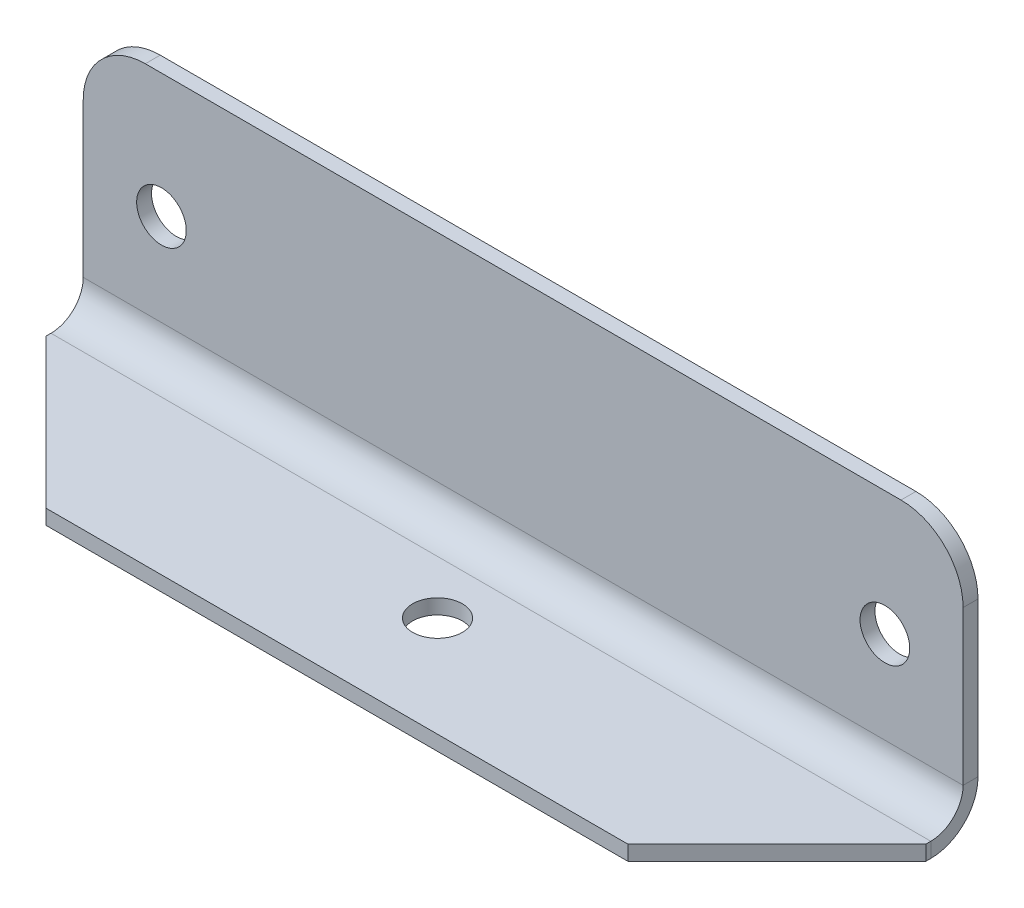
ISO-10303-21;
HEADER;
FILE_DESCRIPTION(('STEP AP214'),'2;1');
FILE_NAME('part.step','',(''),(''),'','','');
FILE_SCHEMA(('AUTOMOTIVE_DESIGN { 1 0 10303 214 1 1 1 1 }'));
ENDSEC;
DATA;
#1=APPLICATION_CONTEXT('core data for automotive mechanical design processes');
#2=APPLICATION_PROTOCOL_DEFINITION('international standard','automotive_design',2000,#1);
#3=PRODUCT_CONTEXT('',#1,'mechanical');
#4=PRODUCT('Part','Part','',(#3));
#5=PRODUCT_RELATED_PRODUCT_CATEGORY('part','',(#4));
#6=PRODUCT_DEFINITION_FORMATION('','',#4);
#7=PRODUCT_DEFINITION_CONTEXT('part definition',#1,'design');
#8=PRODUCT_DEFINITION('design','',#6,#7);
#9=PRODUCT_DEFINITION_SHAPE('','',#8);
#10=(LENGTH_UNIT() NAMED_UNIT(*) SI_UNIT(.MILLI.,.METRE.));
#11=(NAMED_UNIT(*) PLANE_ANGLE_UNIT() SI_UNIT($,.RADIAN.));
#12=(NAMED_UNIT(*) SI_UNIT($,.STERADIAN.) SOLID_ANGLE_UNIT());
#13=UNCERTAINTY_MEASURE_WITH_UNIT(LENGTH_MEASURE(1.E-05),#10,'distance_accuracy_value','');
#14=(GEOMETRIC_REPRESENTATION_CONTEXT(3) GLOBAL_UNCERTAINTY_ASSIGNED_CONTEXT((#13)) GLOBAL_UNIT_ASSIGNED_CONTEXT((#10,
#11,#12)) REPRESENTATION_CONTEXT('',''));
#15=CARTESIAN_POINT('',(0.,0.,0.));
#16=DIRECTION('',(0.,0.,1.));
#17=DIRECTION('',(1.,0.,0.));
#18=AXIS2_PLACEMENT_3D('',#15,#16,#17);
#19=CARTESIAN_POINT('',(45.,1.651,0.));
#20=DIRECTION('',(1.,0.,0.));
#21=DIRECTION('',(0.,0.,-1.));
#22=AXIS2_PLACEMENT_3D('',#19,#20,#21);
#23=PLANE('',#22);
#24=DIRECTION('',(0.,0.,-1.));
#25=VECTOR('',#24,1.);
#26=CARTESIAN_POINT('',(45.,1.651,0.));
#27=LINE('',#26,#25);
#28=CARTESIAN_POINT('',(45.,1.651,0.));
#29=VERTEX_POINT('',#28);
#30=CARTESIAN_POINT('',(45.,1.651,-0.762));
#31=VERTEX_POINT('',#30);
#32=EDGE_CURVE('E126',#29,#31,#27,.T.);
#33=ORIENTED_EDGE('',*,*,#32,.F.);
#34=CARTESIAN_POINT('',(45.,1.651,1.651));
#35=DIRECTION('',(-1.,0.,0.));
#36=DIRECTION('',(0.,0.,1.));
#37=AXIS2_PLACEMENT_3D('',#34,#35,#36);
#38=CIRCLE('',#37,1.651);
#39=CARTESIAN_POINT('',(45.,0.,1.65100000000001));
#40=VERTEX_POINT('',#39);
#41=EDGE_CURVE('E130',#40,#29,#38,.F.);
#42=ORIENTED_EDGE('',*,*,#41,.F.);
#43=DIRECTION('',(0.,1.,0.));
#44=VECTOR('',#43,1.);
#45=CARTESIAN_POINT('',(45.,-0.761999999999999,1.65100000000001));
#46=LINE('',#45,#44);
#47=CARTESIAN_POINT('',(45.,-0.761999999999999,1.65100000000001));
#48=VERTEX_POINT('',#47);
#49=EDGE_CURVE('E135',#48,#40,#46,.T.);
#50=ORIENTED_EDGE('',*,*,#49,.F.);
#51=CARTESIAN_POINT('',(45.,1.651,1.651));
#52=DIRECTION('',(1.,0.,0.));
#53=DIRECTION('',(0.,0.,-1.));
#54=AXIS2_PLACEMENT_3D('',#51,#52,#53);
#55=CIRCLE('',#54,2.413);
#56=EDGE_CURVE('E132',#48,#31,#55,.T.);
#57=ORIENTED_EDGE('',*,*,#56,.T.);
#58=EDGE_LOOP('',(#33,#42,#50,#57));
#59=FACE_BOUND('',#58,.T.);
#60=ADVANCED_FACE('F33',(#59),#23,.T.);
#61=CARTESIAN_POINT('',(45.,-0.761999999999999,1.65100000000001));
#62=DIRECTION('',(1.,0.,0.));
#63=DIRECTION('',(0.,0.,-1.));
#64=AXIS2_PLACEMENT_3D('',#61,#62,#63);
#65=PLANE('',#64);
#66=DIRECTION('',(0.,1.,0.));
#67=VECTOR('',#66,1.);
#68=CARTESIAN_POINT('',(45.,0.,-0.762));
#69=LINE('',#68,#67);
#70=CARTESIAN_POINT('',(45.,9.52499999999999,-0.762));
#71=VERTEX_POINT('',#70);
#72=EDGE_CURVE('E150',#31,#71,#69,.T.);
#73=ORIENTED_EDGE('',*,*,#72,.T.);
#74=DIRECTION('',(0.,0.,-1.));
#75=VECTOR('',#74,1.);
#76=CARTESIAN_POINT('',(45.,9.52500000000001,1.65099999999997));
#77=LINE('',#76,#75);
#78=CARTESIAN_POINT('',(45.,9.525,0.));
#79=VERTEX_POINT('',#78);
#80=EDGE_CURVE('E56',#71,#79,#77,.F.);
#81=ORIENTED_EDGE('',*,*,#80,.T.);
#82=DIRECTION('',(0.,1.,0.));
#83=VECTOR('',#82,1.);
#84=CARTESIAN_POINT('',(45.,0.,0.));
#85=LINE('',#84,#83);
#86=EDGE_CURVE('E140',#29,#79,#85,.T.);
#87=ORIENTED_EDGE('',*,*,#86,.F.);
#88=ORIENTED_EDGE('',*,*,#32,.T.);
#89=EDGE_LOOP('',(#73,#81,#87,#88));
#90=FACE_BOUND('',#89,.T.);
#91=ADVANCED_FACE('F149',(#90),#65,.T.);
#92=CARTESIAN_POINT('',(0.,0.,1.65100000000001));
#93=DIRECTION('',(-1.,0.,0.));
#94=DIRECTION('',(0.,0.,1.));
#95=AXIS2_PLACEMENT_3D('',#92,#93,#94);
#96=PLANE('',#95);
#97=DIRECTION('',(0.,-1.,0.));
#98=VECTOR('',#97,1.);
#99=CARTESIAN_POINT('',(0.,0.,1.65100000000001));
#100=LINE('',#99,#98);
#101=CARTESIAN_POINT('',(0.,0.,1.65100000000001));
#102=VERTEX_POINT('',#101);
#103=CARTESIAN_POINT('',(0.,-0.761999999999999,1.65100000000001));
#104=VERTEX_POINT('',#103);
#105=EDGE_CURVE('E196',#102,#104,#100,.T.);
#106=ORIENTED_EDGE('',*,*,#105,.F.);
#107=CARTESIAN_POINT('',(0.,1.651,1.651));
#108=DIRECTION('',(-1.,0.,0.));
#109=DIRECTION('',(0.,0.,1.));
#110=AXIS2_PLACEMENT_3D('',#107,#108,#109);
#111=CIRCLE('',#110,1.651);
#112=CARTESIAN_POINT('',(0.,1.651,0.));
#113=VERTEX_POINT('',#112);
#114=EDGE_CURVE('E169',#102,#113,#111,.F.);
#115=ORIENTED_EDGE('',*,*,#114,.T.);
#116=DIRECTION('',(0.,0.,1.));
#117=VECTOR('',#116,1.);
#118=CARTESIAN_POINT('',(0.,1.651,-0.762));
#119=LINE('',#118,#117);
#120=CARTESIAN_POINT('',(0.,1.651,-0.762));
#121=VERTEX_POINT('',#120);
#122=EDGE_CURVE('E194',#121,#113,#119,.T.);
#123=ORIENTED_EDGE('',*,*,#122,.F.);
#124=CARTESIAN_POINT('',(0.,1.651,1.651));
#125=DIRECTION('',(1.,0.,0.));
#126=DIRECTION('',(0.,0.,-1.));
#127=AXIS2_PLACEMENT_3D('',#124,#125,#126);
#128=CIRCLE('',#127,2.413);
#129=EDGE_CURVE('E175',#104,#121,#128,.T.);
#130=ORIENTED_EDGE('',*,*,#129,.F.);
#131=EDGE_LOOP('',(#106,#115,#123,#130));
#132=FACE_BOUND('',#131,.T.);
#133=ADVANCED_FACE('F295',(#132),#96,.T.);
#134=CARTESIAN_POINT('',(0.,1.651,-0.762));
#135=DIRECTION('',(-1.,0.,0.));
#136=DIRECTION('',(0.,0.,1.));
#137=AXIS2_PLACEMENT_3D('',#134,#135,#136);
#138=PLANE('',#137);
#139=DIRECTION('',(0.,0.,-1.));
#140=VECTOR('',#139,1.);
#141=CARTESIAN_POINT('',(0.,-0.762,9.525));
#142=LINE('',#141,#140);
#143=CARTESIAN_POINT('',(0.,-0.762,1.905));
#144=VERTEX_POINT('',#143);
#145=EDGE_CURVE('E173',#144,#104,#142,.T.);
#146=ORIENTED_EDGE('',*,*,#145,.F.);
#147=DIRECTION('',(0.,1.,0.));
#148=VECTOR('',#147,1.);
#149=CARTESIAN_POINT('',(0.,1.651,1.905));
#150=LINE('',#149,#148);
#151=CARTESIAN_POINT('',(0.,0.,1.90499999999999));
#152=VERTEX_POINT('',#151);
#153=EDGE_CURVE('E215',#144,#152,#150,.T.);
#154=ORIENTED_EDGE('',*,*,#153,.T.);
#155=DIRECTION('',(0.,0.,-1.));
#156=VECTOR('',#155,1.);
#157=CARTESIAN_POINT('',(0.,0.,9.525));
#158=LINE('',#157,#156);
#159=EDGE_CURVE('E171',#152,#102,#158,.T.);
#160=ORIENTED_EDGE('',*,*,#159,.T.);
#161=ORIENTED_EDGE('',*,*,#105,.T.);
#162=EDGE_LOOP('',(#146,#154,#160,#161));
#163=FACE_BOUND('',#162,.T.);
#164=ADVANCED_FACE('F289',(#163),#138,.T.);
#165=CARTESIAN_POINT('',(45.,0.,-0.762));
#166=DIRECTION('',(0.,0.,1.));
#167=DIRECTION('',(1.,0.,0.));
#168=AXIS2_PLACEMENT_3D('',#165,#166,#167);
#169=PLANE('',#168);
#170=CARTESIAN_POINT('',(4.,6.35,-0.762));
#171=DIRECTION('',(0.,0.,-1.));
#172=DIRECTION('',(-1.,0.,0.));
#173=AXIS2_PLACEMENT_3D('',#170,#171,#172);
#174=CIRCLE('',#173,1.27);
#175=CARTESIAN_POINT('',(2.73,6.35,-0.762));
#176=VERTEX_POINT('',#175);
#177=EDGE_CURVE('E246',#176,#176,#174,.T.);
#178=ORIENTED_EDGE('',*,*,#177,.F.);
#179=EDGE_LOOP('',(#178));
#180=FACE_BOUND('',#179,.T.);
#181=CARTESIAN_POINT('',(41.,6.35,-0.762));
#182=DIRECTION('',(0.,0.,-1.));
#183=DIRECTION('',(-1.,0.,0.));
#184=AXIS2_PLACEMENT_3D('',#181,#182,#183);
#185=CIRCLE('',#184,1.27);
#186=CARTESIAN_POINT('',(39.73,6.35,-0.762));
#187=VERTEX_POINT('',#186);
#188=EDGE_CURVE('E240',#187,#187,#185,.T.);
#189=ORIENTED_EDGE('',*,*,#188,.F.);
#190=EDGE_LOOP('',(#189));
#191=FACE_BOUND('',#190,.T.);
#192=DIRECTION('',(-1.,0.,0.));
#193=VECTOR('',#192,1.);
#194=CARTESIAN_POINT('',(45.,12.7,-0.762));
#195=LINE('',#194,#193);
#196=CARTESIAN_POINT('',(41.825,12.7,-0.762));
#197=VERTEX_POINT('',#196);
#198=CARTESIAN_POINT('',(3.17500000000001,12.7,-0.762));
#199=VERTEX_POINT('',#198);
#200=EDGE_CURVE('E191',#197,#199,#195,.T.);
#201=ORIENTED_EDGE('',*,*,#200,.F.);
#202=CARTESIAN_POINT('',(41.825,9.525,-0.762));
#203=DIRECTION('',(0.,0.,1.));
#204=DIRECTION('',(1.,0.,0.));
#205=AXIS2_PLACEMENT_3D('',#202,#203,#204);
#206=CIRCLE('',#205,3.175);
#207=EDGE_CURVE('E225',#197,#71,#206,.F.);
#208=ORIENTED_EDGE('',*,*,#207,.T.);
#209=ORIENTED_EDGE('',*,*,#72,.F.);
#210=DIRECTION('',(-1.,0.,0.));
#211=VECTOR('',#210,1.);
#212=CARTESIAN_POINT('',(45.,1.651,-0.762));
#213=LINE('',#212,#211);
#214=EDGE_CURVE('E163',#31,#121,#213,.T.);
#215=ORIENTED_EDGE('',*,*,#214,.T.);
#216=DIRECTION('',(0.,1.,0.));
#217=VECTOR('',#216,1.);
#218=CARTESIAN_POINT('',(0.,0.,-0.762));
#219=LINE('',#218,#217);
#220=CARTESIAN_POINT('',(0.,9.52499999999999,-0.762));
#221=VERTEX_POINT('',#220);
#222=EDGE_CURVE('E164',#121,#221,#219,.T.);
#223=ORIENTED_EDGE('',*,*,#222,.T.);
#224=CARTESIAN_POINT('',(3.175,9.525,-0.762));
#225=DIRECTION('',(0.,0.,1.));
#226=DIRECTION('',(1.,0.,0.));
#227=AXIS2_PLACEMENT_3D('',#224,#225,#226);
#228=CIRCLE('',#227,3.175);
#229=EDGE_CURVE('E223',#221,#199,#228,.F.);
#230=ORIENTED_EDGE('',*,*,#229,.T.);
#231=EDGE_LOOP('',(#201,#208,#209,#215,#223,#230));
#232=FACE_BOUND('',#231,.T.);
#233=ADVANCED_FACE('F238',(#180,#191,#232),#169,.F.);
#234=CARTESIAN_POINT('',(45.,12.7,0.));
#235=DIRECTION('',(0.,1.,0.));
#236=DIRECTION('',(0.,0.,1.));
#237=AXIS2_PLACEMENT_3D('',#234,#235,#236);
#238=PLANE('',#237);
#239=DIRECTION('',(-1.,0.,0.));
#240=VECTOR('',#239,1.);
#241=CARTESIAN_POINT('',(45.,12.7,0.));
#242=LINE('',#241,#240);
#243=CARTESIAN_POINT('',(41.825,12.7,0.));
#244=VERTEX_POINT('',#243);
#245=CARTESIAN_POINT('',(3.17500000000001,12.7,0.));
#246=VERTEX_POINT('',#245);
#247=EDGE_CURVE('E146',#244,#246,#242,.T.);
#248=ORIENTED_EDGE('',*,*,#247,.F.);
#249=DIRECTION('',(0.,0.,-1.));
#250=VECTOR('',#249,1.);
#251=CARTESIAN_POINT('',(41.825,12.7,0.));
#252=LINE('',#251,#250);
#253=EDGE_CURVE('E220',#244,#197,#252,.T.);
#254=ORIENTED_EDGE('',*,*,#253,.T.);
#255=ORIENTED_EDGE('',*,*,#200,.T.);
#256=DIRECTION('',(0.,0.,-1.));
#257=VECTOR('',#256,1.);
#258=CARTESIAN_POINT('',(3.175,12.7,0.));
#259=LINE('',#258,#257);
#260=EDGE_CURVE('E218',#199,#246,#259,.F.);
#261=ORIENTED_EDGE('',*,*,#260,.T.);
#262=EDGE_LOOP('',(#248,#254,#255,#261));
#263=FACE_BOUND('',#262,.T.);
#264=ADVANCED_FACE('F232',(#263),#238,.T.);
#265=CARTESIAN_POINT('',(45.,0.,0.));
#266=DIRECTION('',(0.,0.,1.));
#267=DIRECTION('',(1.,0.,0.));
#268=AXIS2_PLACEMENT_3D('',#265,#266,#267);
#269=PLANE('',#268);
#270=CARTESIAN_POINT('',(4.,6.35,0.));
#271=DIRECTION('',(0.,0.,-1.));
#272=DIRECTION('',(-1.,0.,0.));
#273=AXIS2_PLACEMENT_3D('',#270,#271,#272);
#274=CIRCLE('',#273,1.27);
#275=CARTESIAN_POINT('',(2.73,6.35,0.));
#276=VERTEX_POINT('',#275);
#277=EDGE_CURVE('E243',#276,#276,#274,.T.);
#278=ORIENTED_EDGE('',*,*,#277,.T.);
#279=EDGE_LOOP('',(#278));
#280=FACE_BOUND('',#279,.T.);
#281=CARTESIAN_POINT('',(41.,6.35,0.));
#282=DIRECTION('',(0.,0.,-1.));
#283=DIRECTION('',(-1.,0.,0.));
#284=AXIS2_PLACEMENT_3D('',#281,#282,#283);
#285=CIRCLE('',#284,1.27);
#286=CARTESIAN_POINT('',(39.73,6.35,0.));
#287=VERTEX_POINT('',#286);
#288=EDGE_CURVE('E167',#287,#287,#285,.T.);
#289=ORIENTED_EDGE('',*,*,#288,.T.);
#290=EDGE_LOOP('',(#289));
#291=FACE_BOUND('',#290,.T.);
#292=ORIENTED_EDGE('',*,*,#86,.T.);
#293=CARTESIAN_POINT('',(41.825,9.525,0.));
#294=DIRECTION('',(0.,0.,1.));
#295=DIRECTION('',(1.,0.,0.));
#296=AXIS2_PLACEMENT_3D('',#293,#294,#295);
#297=CIRCLE('',#296,3.175);
#298=EDGE_CURVE('E41',#79,#244,#297,.T.);
#299=ORIENTED_EDGE('',*,*,#298,.T.);
#300=ORIENTED_EDGE('',*,*,#247,.T.);
#301=CARTESIAN_POINT('',(3.175,9.525,0.));
#302=DIRECTION('',(0.,0.,1.));
#303=DIRECTION('',(1.,0.,0.));
#304=AXIS2_PLACEMENT_3D('',#301,#302,#303);
#305=CIRCLE('',#304,3.175);
#306=CARTESIAN_POINT('',(0.,9.525,0.));
#307=VERTEX_POINT('',#306);
#308=EDGE_CURVE('E48',#246,#307,#305,.T.);
#309=ORIENTED_EDGE('',*,*,#308,.T.);
#310=DIRECTION('',(0.,1.,0.));
#311=VECTOR('',#310,1.);
#312=CARTESIAN_POINT('',(0.,0.,0.));
#313=LINE('',#312,#311);
#314=EDGE_CURVE('E142',#113,#307,#313,.T.);
#315=ORIENTED_EDGE('',*,*,#314,.F.);
#316=DIRECTION('',(-1.,0.,0.));
#317=VECTOR('',#316,1.);
#318=CARTESIAN_POINT('',(45.,1.651,0.));
#319=LINE('',#318,#317);
#320=EDGE_CURVE('E138',#29,#113,#319,.T.);
#321=ORIENTED_EDGE('',*,*,#320,.F.);
#322=EDGE_LOOP('',(#292,#299,#300,#309,#315,#321));
#323=FACE_BOUND('',#322,.T.);
#324=ADVANCED_FACE('F139',(#280,#291,#323),#269,.T.);
#325=CARTESIAN_POINT('',(45.,1.651,1.651));
#326=DIRECTION('',(-1.,0.,0.));
#327=DIRECTION('',(0.,0.,1.));
#328=AXIS2_PLACEMENT_3D('',#325,#326,#327);
#329=CYLINDRICAL_SURFACE('',#328,1.651);
#330=ORIENTED_EDGE('',*,*,#114,.F.);
#331=DIRECTION('',(-1.,0.,0.));
#332=VECTOR('',#331,1.);
#333=CARTESIAN_POINT('',(45.,0.,1.65100000000001));
#334=LINE('',#333,#332);
#335=EDGE_CURVE('E147',#40,#102,#334,.T.);
#336=ORIENTED_EDGE('',*,*,#335,.F.);
#337=ORIENTED_EDGE('',*,*,#41,.T.);
#338=ORIENTED_EDGE('',*,*,#320,.T.);
#339=EDGE_LOOP('',(#330,#336,#337,#338));
#340=FACE_BOUND('',#339,.T.);
#341=ADVANCED_FACE('F153',(#340),#329,.F.);
#342=CARTESIAN_POINT('',(45.,0.,9.525));
#343=DIRECTION('',(0.,1.,0.));
#344=DIRECTION('',(0.,0.,1.));
#345=AXIS2_PLACEMENT_3D('',#342,#343,#344);
#346=PLANE('',#345);
#347=CARTESIAN_POINT('',(22.5,0.,4.3815));
#348=DIRECTION('',(0.,1.,0.));
#349=DIRECTION('',(0.,0.,1.));
#350=AXIS2_PLACEMENT_3D('',#347,#348,#349);
#351=CIRCLE('',#350,1.27);
#352=CARTESIAN_POINT('',(22.5,0.,5.6515));
#353=VERTEX_POINT('',#352);
#354=EDGE_CURVE('E252',#353,#353,#351,.T.);
#355=ORIENTED_EDGE('',*,*,#354,.F.);
#356=EDGE_LOOP('',(#355));
#357=FACE_BOUND('',#356,.T.);
#358=DIRECTION('',(-1.,0.,0.));
#359=VECTOR('',#358,1.);
#360=CARTESIAN_POINT('',(45.,0.,9.525));
#361=LINE('',#360,#359);
#362=CARTESIAN_POINT('',(37.38,0.,9.525));
#363=VERTEX_POINT('',#362);
#364=CARTESIAN_POINT('',(7.62000000000004,0.,9.525));
#365=VERTEX_POINT('',#364);
#366=EDGE_CURVE('E186',#363,#365,#361,.T.);
#367=ORIENTED_EDGE('',*,*,#366,.F.);
#368=DIRECTION('',(0.707106781186546,0.,-0.707106781186549));
#369=VECTOR('',#368,1.);
#370=CARTESIAN_POINT('',(41.19,0.,5.71500000000001));
#371=LINE('',#370,#369);
#372=CARTESIAN_POINT('',(45.,0.,1.90499999999999));
#373=VERTEX_POINT('',#372);
#374=EDGE_CURVE('E207',#363,#373,#371,.T.);
#375=ORIENTED_EDGE('',*,*,#374,.T.);
#376=DIRECTION('',(0.,0.,-1.));
#377=VECTOR('',#376,1.);
#378=CARTESIAN_POINT('',(45.,0.,9.525));
#379=LINE('',#378,#377);
#380=EDGE_CURVE('E155',#373,#40,#379,.T.);
#381=ORIENTED_EDGE('',*,*,#380,.T.);
#382=ORIENTED_EDGE('',*,*,#335,.T.);
#383=ORIENTED_EDGE('',*,*,#159,.F.);
#384=DIRECTION('',(-0.707106781186549,0.,-0.707106781186546));
#385=VECTOR('',#384,1.);
#386=CARTESIAN_POINT('',(26.3100000000001,0.,28.215));
#387=LINE('',#386,#385);
#388=EDGE_CURVE('E205',#152,#365,#387,.F.);
#389=ORIENTED_EDGE('',*,*,#388,.T.);
#390=EDGE_LOOP('',(#367,#375,#381,#382,#383,#389));
#391=FACE_BOUND('',#390,.T.);
#392=ADVANCED_FACE('F269',(#357,#391),#346,.T.);
#393=CARTESIAN_POINT('',(45.,-0.762,9.525));
#394=DIRECTION('',(0.,0.,1.));
#395=DIRECTION('',(1.,0.,0.));
#396=AXIS2_PLACEMENT_3D('',#393,#394,#395);
#397=PLANE('',#396);
#398=DIRECTION('',(-1.,0.,0.));
#399=VECTOR('',#398,1.);
#400=CARTESIAN_POINT('',(45.,-0.762,9.525));
#401=LINE('',#400,#399);
#402=CARTESIAN_POINT('',(37.38,-0.762,9.525));
#403=VERTEX_POINT('',#402);
#404=CARTESIAN_POINT('',(7.62000000000005,-0.762,9.52500000000001));
#405=VERTEX_POINT('',#404);
#406=EDGE_CURVE('E183',#403,#405,#401,.T.);
#407=ORIENTED_EDGE('',*,*,#406,.F.);
#408=DIRECTION('',(0.,1.,0.));
#409=VECTOR('',#408,1.);
#410=CARTESIAN_POINT('',(37.38,0.,9.525));
#411=LINE('',#410,#409);
#412=EDGE_CURVE('E202',#403,#363,#411,.T.);
#413=ORIENTED_EDGE('',*,*,#412,.T.);
#414=ORIENTED_EDGE('',*,*,#366,.T.);
#415=DIRECTION('',(0.,-1.,0.));
#416=VECTOR('',#415,1.);
#417=CARTESIAN_POINT('',(7.62000000000003,-0.762,9.525));
#418=LINE('',#417,#416);
#419=EDGE_CURVE('E134',#365,#405,#418,.T.);
#420=ORIENTED_EDGE('',*,*,#419,.T.);
#421=EDGE_LOOP('',(#407,#413,#414,#420));
#422=FACE_BOUND('',#421,.T.);
#423=ADVANCED_FACE('F272',(#422),#397,.T.);
#424=CARTESIAN_POINT('',(45.,-0.762,9.525));
#425=DIRECTION('',(0.,1.,0.));
#426=DIRECTION('',(0.,0.,1.));
#427=AXIS2_PLACEMENT_3D('',#424,#425,#426);
#428=PLANE('',#427);
#429=CARTESIAN_POINT('',(22.5,-0.762,4.3815));
#430=DIRECTION('',(0.,1.,0.));
#431=DIRECTION('',(0.,0.,1.));
#432=AXIS2_PLACEMENT_3D('',#429,#430,#431);
#433=CIRCLE('',#432,1.27);
#434=CARTESIAN_POINT('',(22.5,-0.762,5.6515));
#435=VERTEX_POINT('',#434);
#436=EDGE_CURVE('E249',#435,#435,#433,.T.);
#437=ORIENTED_EDGE('',*,*,#436,.T.);
#438=EDGE_LOOP('',(#437));
#439=FACE_BOUND('',#438,.T.);
#440=DIRECTION('',(0.,0.,-1.));
#441=VECTOR('',#440,1.);
#442=CARTESIAN_POINT('',(45.,-0.762,9.525));
#443=LINE('',#442,#441);
#444=CARTESIAN_POINT('',(45.,-0.762,1.90499999999999));
#445=VERTEX_POINT('',#444);
#446=EDGE_CURVE('E157',#445,#48,#443,.T.);
#447=ORIENTED_EDGE('',*,*,#446,.F.);
#448=DIRECTION('',(-0.707106781186546,0.,0.707106781186549));
#449=VECTOR('',#448,1.);
#450=CARTESIAN_POINT('',(37.38,-0.762,9.525));
#451=LINE('',#450,#449);
#452=EDGE_CURVE('E213',#445,#403,#451,.T.);
#453=ORIENTED_EDGE('',*,*,#452,.T.);
#454=ORIENTED_EDGE('',*,*,#406,.T.);
#455=DIRECTION('',(0.707106781186549,0.,0.707106781186546));
#456=VECTOR('',#455,1.);
#457=CARTESIAN_POINT('',(0.,-0.762,1.905));
#458=LINE('',#457,#456);
#459=EDGE_CURVE('E211',#405,#144,#458,.F.);
#460=ORIENTED_EDGE('',*,*,#459,.T.);
#461=ORIENTED_EDGE('',*,*,#145,.T.);
#462=DIRECTION('',(-1.,0.,0.));
#463=VECTOR('',#462,1.);
#464=CARTESIAN_POINT('',(45.,-0.761999999999999,1.65100000000001));
#465=LINE('',#464,#463);
#466=EDGE_CURVE('E180',#48,#104,#465,.T.);
#467=ORIENTED_EDGE('',*,*,#466,.F.);
#468=EDGE_LOOP('',(#447,#453,#454,#460,#461,#467));
#469=FACE_BOUND('',#468,.T.);
#470=ADVANCED_FACE('F258',(#439,#469),#428,.F.);
#471=CARTESIAN_POINT('',(45.,1.651,1.651));
#472=DIRECTION('',(-1.,0.,0.));
#473=DIRECTION('',(0.,0.,1.));
#474=AXIS2_PLACEMENT_3D('',#471,#472,#473);
#475=CYLINDRICAL_SURFACE('',#474,2.413);
#476=ORIENTED_EDGE('',*,*,#129,.T.);
#477=ORIENTED_EDGE('',*,*,#214,.F.);
#478=ORIENTED_EDGE('',*,*,#56,.F.);
#479=ORIENTED_EDGE('',*,*,#466,.T.);
#480=EDGE_LOOP('',(#476,#477,#478,#479));
#481=FACE_BOUND('',#480,.T.);
#482=ADVANCED_FACE('F294',(#481),#475,.T.);
#483=CARTESIAN_POINT('',(45.,1.651,1.651));
#484=DIRECTION('',(-1.,0.,0.));
#485=DIRECTION('',(0.,0.,1.));
#486=AXIS2_PLACEMENT_3D('',#483,#484,#485);
#487=PLANE('',#486);
#488=ORIENTED_EDGE('',*,*,#380,.F.);
#489=DIRECTION('',(0.,-1.,0.));
#490=VECTOR('',#489,1.);
#491=CARTESIAN_POINT('',(45.,-0.762,1.90499999999999));
#492=LINE('',#491,#490);
#493=EDGE_CURVE('E209',#373,#445,#492,.T.);
#494=ORIENTED_EDGE('',*,*,#493,.T.);
#495=ORIENTED_EDGE('',*,*,#446,.T.);
#496=ORIENTED_EDGE('',*,*,#49,.T.);
#497=EDGE_LOOP('',(#488,#494,#495,#496));
#498=FACE_BOUND('',#497,.T.);
#499=ADVANCED_FACE('F340',(#498),#487,.F.);
#500=CARTESIAN_POINT('',(0.,1.651,1.651));
#501=DIRECTION('',(-1.,0.,0.));
#502=DIRECTION('',(0.,0.,1.));
#503=AXIS2_PLACEMENT_3D('',#500,#501,#502);
#504=PLANE('',#503);
#505=ORIENTED_EDGE('',*,*,#314,.T.);
#506=DIRECTION('',(0.,0.,-1.));
#507=VECTOR('',#506,1.);
#508=CARTESIAN_POINT('',(0.,9.52500000000001,1.65099999999997));
#509=LINE('',#508,#507);
#510=EDGE_CURVE('E11',#307,#221,#509,.T.);
#511=ORIENTED_EDGE('',*,*,#510,.T.);
#512=ORIENTED_EDGE('',*,*,#222,.F.);
#513=ORIENTED_EDGE('',*,*,#122,.T.);
#514=EDGE_LOOP('',(#505,#511,#512,#513));
#515=FACE_BOUND('',#514,.T.);
#516=ADVANCED_FACE('F298',(#515),#504,.T.);
#517=CARTESIAN_POINT('',(41.,6.35,0.));
#518=DIRECTION('',(0.,0.,-1.));
#519=DIRECTION('',(-1.,0.,0.));
#520=AXIS2_PLACEMENT_3D('',#517,#518,#519);
#521=CYLINDRICAL_SURFACE('',#520,1.27);
#522=ORIENTED_EDGE('',*,*,#288,.F.);
#523=EDGE_LOOP('',(#522));
#524=FACE_BOUND('',#523,.T.);
#525=ORIENTED_EDGE('',*,*,#188,.T.);
#526=EDGE_LOOP('',(#525));
#527=FACE_BOUND('',#526,.T.);
#528=ADVANCED_FACE('F339',(#524,#527),#521,.F.);
#529=CARTESIAN_POINT('',(4.,6.35,0.));
#530=DIRECTION('',(0.,0.,-1.));
#531=DIRECTION('',(-1.,0.,0.));
#532=AXIS2_PLACEMENT_3D('',#529,#530,#531);
#533=CYLINDRICAL_SURFACE('',#532,1.27);
#534=ORIENTED_EDGE('',*,*,#277,.F.);
#535=EDGE_LOOP('',(#534));
#536=FACE_BOUND('',#535,.T.);
#537=ORIENTED_EDGE('',*,*,#177,.T.);
#538=EDGE_LOOP('',(#537));
#539=FACE_BOUND('',#538,.T.);
#540=ADVANCED_FACE('F265',(#536,#539),#533,.F.);
#541=CARTESIAN_POINT('',(22.5,-0.762,4.3815));
#542=DIRECTION('',(0.,1.,0.));
#543=DIRECTION('',(0.,0.,1.));
#544=AXIS2_PLACEMENT_3D('',#541,#542,#543);
#545=CYLINDRICAL_SURFACE('',#544,1.27);
#546=ORIENTED_EDGE('',*,*,#436,.F.);
#547=EDGE_LOOP('',(#546));
#548=FACE_BOUND('',#547,.T.);
#549=ORIENTED_EDGE('',*,*,#354,.T.);
#550=EDGE_LOOP('',(#549));
#551=FACE_BOUND('',#550,.T.);
#552=ADVANCED_FACE('F261',(#548,#551),#545,.F.);
#553=CARTESIAN_POINT('',(37.38,-0.762,9.525));
#554=DIRECTION('',(0.707106781186549,0.,0.707106781186546));
#555=DIRECTION('',(0.707106781186546,0.,-0.707106781186549));
#556=AXIS2_PLACEMENT_3D('',#553,#554,#555);
#557=PLANE('',#556);
#558=ORIENTED_EDGE('',*,*,#452,.F.);
#559=ORIENTED_EDGE('',*,*,#493,.F.);
#560=ORIENTED_EDGE('',*,*,#374,.F.);
#561=ORIENTED_EDGE('',*,*,#412,.F.);
#562=EDGE_LOOP('',(#558,#559,#560,#561));
#563=FACE_BOUND('',#562,.T.);
#564=ADVANCED_FACE('F264',(#563),#557,.T.);
#565=CARTESIAN_POINT('',(0.,1.651,1.905));
#566=DIRECTION('',(0.707106781186546,0.,-0.707106781186549));
#567=DIRECTION('',(-0.707106781186549,0.,-0.707106781186546));
#568=AXIS2_PLACEMENT_3D('',#565,#566,#567);
#569=PLANE('',#568);
#570=ORIENTED_EDGE('',*,*,#459,.F.);
#571=ORIENTED_EDGE('',*,*,#419,.F.);
#572=ORIENTED_EDGE('',*,*,#388,.F.);
#573=ORIENTED_EDGE('',*,*,#153,.F.);
#574=EDGE_LOOP('',(#570,#571,#572,#573));
#575=FACE_BOUND('',#574,.T.);
#576=ADVANCED_FACE('F283',(#575),#569,.F.);
#577=CARTESIAN_POINT('',(41.825,9.525,0.));
#578=DIRECTION('',(0.,0.,-1.));
#579=DIRECTION('',(0.,1.,0.));
#580=AXIS2_PLACEMENT_3D('',#577,#578,#579);
#581=CYLINDRICAL_SURFACE('',#580,3.175);
#582=ORIENTED_EDGE('',*,*,#298,.F.);
#583=ORIENTED_EDGE('',*,*,#80,.F.);
#584=ORIENTED_EDGE('',*,*,#207,.F.);
#585=ORIENTED_EDGE('',*,*,#253,.F.);
#586=EDGE_LOOP('',(#582,#583,#584,#585));
#587=FACE_BOUND('',#586,.T.);
#588=ADVANCED_FACE('F235',(#587),#581,.T.);
#589=CARTESIAN_POINT('',(3.175,9.52500000000001,1.65099999999997));
#590=DIRECTION('',(0.,0.,-1.));
#591=DIRECTION('',(0.,1.,0.));
#592=AXIS2_PLACEMENT_3D('',#589,#590,#591);
#593=CYLINDRICAL_SURFACE('',#592,3.175);
#594=ORIENTED_EDGE('',*,*,#308,.F.);
#595=ORIENTED_EDGE('',*,*,#260,.F.);
#596=ORIENTED_EDGE('',*,*,#229,.F.);
#597=ORIENTED_EDGE('',*,*,#510,.F.);
#598=EDGE_LOOP('',(#594,#595,#596,#597));
#599=FACE_BOUND('',#598,.T.);
#600=ADVANCED_FACE('F35',(#599),#593,.T.);
#601=CLOSED_SHELL('',(#60,#91,#133,#164,#233,#264,#324,#341,#392,#423,#470,#482,#499,#516,#528,
#540,#552,#564,#576,#588,#600));
#602=MANIFOLD_SOLID_BREP('B2',#601);
#603=ADVANCED_BREP_SHAPE_REPRESENTATION('',(#18,#602),#14);
#604=SHAPE_DEFINITION_REPRESENTATION(#9,#603);
ENDSEC;
END-ISO-10303-21;
